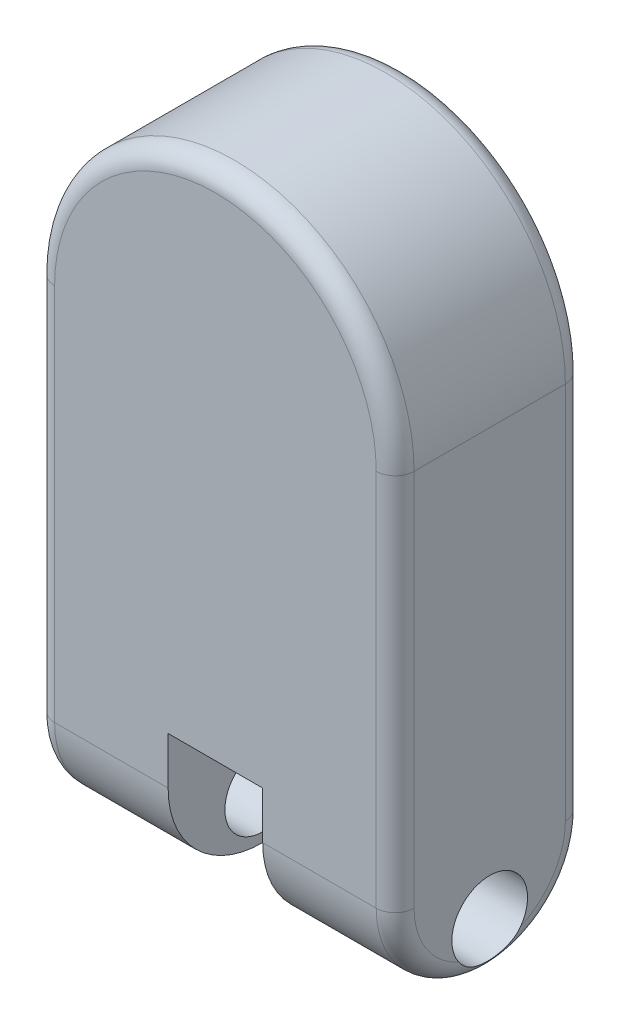
ISO-10303-21;
HEADER;
FILE_DESCRIPTION(('STEP AP214'),'2;1');
FILE_NAME('part.step','',(''),(''),'','','');
FILE_SCHEMA(('AUTOMOTIVE_DESIGN { 1 0 10303 214 1 1 1 1 }'));
ENDSEC;
DATA;
#1=APPLICATION_CONTEXT('core data for automotive mechanical design processes');
#2=APPLICATION_PROTOCOL_DEFINITION('international standard','automotive_design',2000,#1);
#3=PRODUCT_CONTEXT('',#1,'mechanical');
#4=PRODUCT('Part','Part','',(#3));
#5=PRODUCT_RELATED_PRODUCT_CATEGORY('part','',(#4));
#6=PRODUCT_DEFINITION_FORMATION('','',#4);
#7=PRODUCT_DEFINITION_CONTEXT('part definition',#1,'design');
#8=PRODUCT_DEFINITION('design','',#6,#7);
#9=PRODUCT_DEFINITION_SHAPE('','',#8);
#10=(LENGTH_UNIT() NAMED_UNIT(*) SI_UNIT(.MILLI.,.METRE.));
#11=(NAMED_UNIT(*) PLANE_ANGLE_UNIT() SI_UNIT($,.RADIAN.));
#12=(NAMED_UNIT(*) SI_UNIT($,.STERADIAN.) SOLID_ANGLE_UNIT());
#13=UNCERTAINTY_MEASURE_WITH_UNIT(LENGTH_MEASURE(1.E-05),#10,'distance_accuracy_value','');
#14=(GEOMETRIC_REPRESENTATION_CONTEXT(3) GLOBAL_UNCERTAINTY_ASSIGNED_CONTEXT((#13)) GLOBAL_UNIT_ASSIGNED_CONTEXT((#10,
#11,#12)) REPRESENTATION_CONTEXT('',''));
#15=CARTESIAN_POINT('',(0.,0.,0.));
#16=DIRECTION('',(0.,0.,1.));
#17=DIRECTION('',(1.,0.,0.));
#18=AXIS2_PLACEMENT_3D('',#15,#16,#17);
#19=CARTESIAN_POINT('',(-25.,-75.,-100.1));
#20=DIRECTION('',(0.,-1.,0.));
#21=DIRECTION('',(0.,0.,-1.));
#22=AXIS2_PLACEMENT_3D('',#19,#20,#21);
#23=PLANE('',#22);
#24=DIRECTION('',(1.,0.,0.));
#25=VECTOR('',#24,1.);
#26=CARTESIAN_POINT('',(-25.,-75.,-100.));
#27=LINE('',#26,#25);
#28=CARTESIAN_POINT('',(-25.,-75.,-100.));
#29=VERTEX_POINT('',#28);
#30=CARTESIAN_POINT('',(25.,-75.,-100.));
#31=VERTEX_POINT('',#30);
#32=EDGE_CURVE('E92',#29,#31,#27,.T.);
#33=ORIENTED_EDGE('',*,*,#32,.T.);
#34=CARTESIAN_POINT('',(23.5893264020334,-75.,-90.1));
#35=DIRECTION('',(0.,-1.,0.));
#36=DIRECTION('',(0.,0.,-1.));
#37=AXIS2_PLACEMENT_3D('',#34,#35,#36);
#38=CIRCLE('',#37,10.);
#39=CARTESIAN_POINT('',(23.5893264020334,-75.,-100.1));
#40=VERTEX_POINT('',#39);
#41=EDGE_CURVE('E12',#31,#40,#38,.F.);
#42=ORIENTED_EDGE('',*,*,#41,.T.);
#43=DIRECTION('',(1.,0.,0.));
#44=VECTOR('',#43,1.);
#45=CARTESIAN_POINT('',(-25.,-75.,-100.1));
#46=LINE('',#45,#44);
#47=CARTESIAN_POINT('',(-23.5893264020334,-75.,-100.1));
#48=VERTEX_POINT('',#47);
#49=EDGE_CURVE('E116',#48,#40,#46,.T.);
#50=ORIENTED_EDGE('',*,*,#49,.F.);
#51=CARTESIAN_POINT('',(-23.5893264020334,-75.,-90.1));
#52=DIRECTION('',(0.,-1.,0.));
#53=DIRECTION('',(0.,0.,-1.));
#54=AXIS2_PLACEMENT_3D('',#51,#52,#53);
#55=CIRCLE('',#54,10.);
#56=EDGE_CURVE('E55',#48,#29,#55,.F.);
#57=ORIENTED_EDGE('',*,*,#56,.T.);
#58=EDGE_LOOP('',(#33,#42,#50,#57));
#59=FACE_BOUND('',#58,.T.);
#60=ADVANCED_FACE('F46',(#59),#23,.F.);
#61=CARTESIAN_POINT('',(0.,0.,-100.1));
#62=DIRECTION('',(0.,0.,-1.));
#63=DIRECTION('',(-1.,0.,0.));
#64=AXIS2_PLACEMENT_3D('',#61,#62,#63);
#65=PLANE('',#64);
#66=ORIENTED_EDGE('',*,*,#49,.T.);
#67=DIRECTION('',(0.,1.,0.));
#68=VECTOR('',#67,1.);
#69=CARTESIAN_POINT('',(23.5893264020334,-105.,-100.1));
#70=LINE('',#69,#68);
#71=CARTESIAN_POINT('',(23.5893264020334,-103.589326402033,-100.1));
#72=VERTEX_POINT('',#71);
#73=EDGE_CURVE('E104',#40,#72,#70,.F.);
#74=ORIENTED_EDGE('',*,*,#73,.T.);
#75=DIRECTION('',(1.,0.,0.));
#76=VECTOR('',#75,1.);
#77=CARTESIAN_POINT('',(-25.,-103.589326402033,-100.1));
#78=LINE('',#77,#76);
#79=CARTESIAN_POINT('',(-23.5893264020334,-103.589326402033,-100.1));
#80=VERTEX_POINT('',#79);
#81=EDGE_CURVE('E70',#72,#80,#78,.F.);
#82=ORIENTED_EDGE('',*,*,#81,.T.);
#83=DIRECTION('',(0.,-1.,0.));
#84=VECTOR('',#83,1.);
#85=CARTESIAN_POINT('',(-23.5893264020334,-75.,-100.1));
#86=LINE('',#85,#84);
#87=EDGE_CURVE('E107',#80,#48,#86,.F.);
#88=ORIENTED_EDGE('',*,*,#87,.T.);
#89=EDGE_LOOP('',(#66,#74,#82,#88));
#90=FACE_BOUND('',#89,.T.);
#91=ADVANCED_FACE('F120',(#90),#65,.T.);
#92=CARTESIAN_POINT('',(0.,0.,-100.));
#93=DIRECTION('',(0.,0.,-1.));
#94=DIRECTION('',(-1.,0.,0.));
#95=AXIS2_PLACEMENT_3D('',#92,#93,#94);
#96=PLANE('',#95);
#97=ORIENTED_EDGE('',*,*,#32,.F.);
#98=DIRECTION('',(0.,1.,0.));
#99=VECTOR('',#98,1.);
#100=CARTESIAN_POINT('',(-25.,-105.,-100.));
#101=LINE('',#100,#99);
#102=CARTESIAN_POINT('',(-25.,-105.,-100.));
#103=VERTEX_POINT('',#102);
#104=EDGE_CURVE('E115',#103,#29,#101,.T.);
#105=ORIENTED_EDGE('',*,*,#104,.F.);
#106=DIRECTION('',(-1.,0.,0.));
#107=VECTOR('',#106,1.);
#108=CARTESIAN_POINT('',(25.,-105.,-100.));
#109=LINE('',#108,#107);
#110=CARTESIAN_POINT('',(25.,-105.,-100.));
#111=VERTEX_POINT('',#110);
#112=EDGE_CURVE('E95',#111,#103,#109,.T.);
#113=ORIENTED_EDGE('',*,*,#112,.F.);
#114=DIRECTION('',(0.,-1.,0.));
#115=VECTOR('',#114,1.);
#116=CARTESIAN_POINT('',(25.,-75.,-100.));
#117=LINE('',#116,#115);
#118=EDGE_CURVE('E89',#31,#111,#117,.T.);
#119=ORIENTED_EDGE('',*,*,#118,.F.);
#120=EDGE_LOOP('',(#97,#105,#113,#119));
#121=FACE_BOUND('',#120,.T.);
#122=ADVANCED_FACE('F91',(#121),#96,.F.);
#123=CARTESIAN_POINT('',(-23.5893264020334,-105.,-90.1));
#124=DIRECTION('',(0.,1.,0.));
#125=DIRECTION('',(0.,0.,1.));
#126=AXIS2_PLACEMENT_3D('',#123,#124,#125);
#127=CYLINDRICAL_SURFACE('',#126,10.);
#128=ORIENTED_EDGE('',*,*,#56,.F.);
#129=ORIENTED_EDGE('',*,*,#87,.F.);
#130=CARTESIAN_POINT('',(-23.5893264020334,-103.589326402033,-90.1));
#131=DIRECTION('',(-0.707106781186547,0.707106781186547,0.));
#132=DIRECTION('',(0.707106781186547,0.707106781186547,0.));
#133=AXIS2_PLACEMENT_3D('',#130,#131,#132);
#134=ELLIPSE('',#133,14.1421356237309,10.);
#135=EDGE_CURVE('E50',#103,#80,#134,.F.);
#136=ORIENTED_EDGE('',*,*,#135,.F.);
#137=ORIENTED_EDGE('',*,*,#104,.T.);
#138=EDGE_LOOP('',(#128,#129,#136,#137));
#139=FACE_BOUND('',#138,.T.);
#140=ADVANCED_FACE('F48',(#139),#127,.T.);
#141=CARTESIAN_POINT('',(25.,-103.589326402033,-90.1));
#142=DIRECTION('',(-1.,0.,0.));
#143=DIRECTION('',(0.,0.,1.));
#144=AXIS2_PLACEMENT_3D('',#141,#142,#143);
#145=CYLINDRICAL_SURFACE('',#144,10.);
#146=ORIENTED_EDGE('',*,*,#135,.T.);
#147=ORIENTED_EDGE('',*,*,#81,.F.);
#148=CARTESIAN_POINT('',(23.5893264020334,-103.589326402033,-90.1));
#149=DIRECTION('',(-0.707106781186547,-0.707106781186548,0.));
#150=DIRECTION('',(-0.707106781186548,0.707106781186547,0.));
#151=AXIS2_PLACEMENT_3D('',#148,#149,#150);
#152=ELLIPSE('',#151,14.142135623731,10.);
#153=EDGE_CURVE('E63',#111,#72,#152,.F.);
#154=ORIENTED_EDGE('',*,*,#153,.F.);
#155=ORIENTED_EDGE('',*,*,#112,.T.);
#156=EDGE_LOOP('',(#146,#147,#154,#155));
#157=FACE_BOUND('',#156,.T.);
#158=ADVANCED_FACE('F113',(#157),#145,.T.);
#159=CARTESIAN_POINT('',(23.5893264020334,-75.,-90.1));
#160=DIRECTION('',(0.,-1.,0.));
#161=DIRECTION('',(1.,0.,0.));
#162=AXIS2_PLACEMENT_3D('',#159,#160,#161);
#163=CYLINDRICAL_SURFACE('',#162,10.);
#164=ORIENTED_EDGE('',*,*,#41,.F.);
#165=ORIENTED_EDGE('',*,*,#118,.T.);
#166=ORIENTED_EDGE('',*,*,#153,.T.);
#167=ORIENTED_EDGE('',*,*,#73,.F.);
#168=EDGE_LOOP('',(#164,#165,#166,#167));
#169=FACE_BOUND('',#168,.T.);
#170=ADVANCED_FACE('F103',(#169),#163,.T.);
#171=CLOSED_SHELL('',(#60,#91,#122,#140,#158,#170));
#172=MANIFOLD_SOLID_BREP('B2',#171);
#173=CARTESIAN_POINT('',(0.,-75.,-50.));
#174=DIRECTION('',(1.,0.,0.));
#175=DIRECTION('',(0.,0.,-1.));
#176=AXIS2_PLACEMENT_3D('',#173,#174,#175);
#177=CYLINDRICAL_SURFACE('',#176,50.);
#178=DIRECTION('',(1.,0.,0.));
#179=VECTOR('',#178,1.);
#180=CARTESIAN_POINT('',(0.,-75.,0.));
#181=LINE('',#180,#179);
#182=CARTESIAN_POINT('',(-85.,-75.,0.));
#183=VERTEX_POINT('',#182);
#184=CARTESIAN_POINT('',(-25.,-75.,0.));
#185=VERTEX_POINT('',#184);
#186=EDGE_CURVE('E367',#183,#185,#181,.T.);
#187=ORIENTED_EDGE('',*,*,#186,.F.);
#188=CARTESIAN_POINT('',(-85.,-75.,-50.));
#189=DIRECTION('',(-1.,0.,0.));
#190=DIRECTION('',(0.,-1.,0.));
#191=AXIS2_PLACEMENT_3D('',#188,#189,#190);
#192=CIRCLE('',#191,50.);
#193=CARTESIAN_POINT('',(-85.,-125.,-50.));
#194=VERTEX_POINT('',#193);
#195=EDGE_CURVE('E191',#183,#194,#192,.F.);
#196=ORIENTED_EDGE('',*,*,#195,.T.);
#197=DIRECTION('',(1.,0.,0.));
#198=VECTOR('',#197,1.);
#199=CARTESIAN_POINT('',(-95.,-125.,-50.));
#200=LINE('',#199,#198);
#201=CARTESIAN_POINT('',(-25.,-125.,-50.));
#202=VERTEX_POINT('',#201);
#203=EDGE_CURVE('E334',#202,#194,#200,.F.);
#204=ORIENTED_EDGE('',*,*,#203,.F.);
#205=CARTESIAN_POINT('',(-25.,-75.,-50.));
#206=DIRECTION('',(-1.,0.,0.));
#207=DIRECTION('',(0.,0.,1.));
#208=AXIS2_PLACEMENT_3D('',#205,#206,#207);
#209=CIRCLE('',#208,50.);
#210=EDGE_CURVE('E349',#185,#202,#209,.F.);
#211=ORIENTED_EDGE('',*,*,#210,.F.);
#212=EDGE_LOOP('',(#187,#196,#204,#211));
#213=FACE_BOUND('',#212,.T.);
#214=ADVANCED_FACE('F169',(#213),#177,.T.);
#215=CARTESIAN_POINT('',(-95.,-75.,-50.));
#216=DIRECTION('',(-1.,0.,0.));
#217=DIRECTION('',(0.,0.,1.));
#218=AXIS2_PLACEMENT_3D('',#215,#216,#217);
#219=CYLINDRICAL_SURFACE('',#218,50.);
#220=ORIENTED_EDGE('',*,*,#203,.T.);
#221=CARTESIAN_POINT('',(-85.,-75.,-50.));
#222=DIRECTION('',(-1.,0.,0.));
#223=DIRECTION('',(0.,-1.,0.));
#224=AXIS2_PLACEMENT_3D('',#221,#222,#223);
#225=CIRCLE('',#224,50.);
#226=CARTESIAN_POINT('',(-85.,-75.,-100.));
#227=VERTEX_POINT('',#226);
#228=EDGE_CURVE('E177',#194,#227,#225,.F.);
#229=ORIENTED_EDGE('',*,*,#228,.T.);
#230=DIRECTION('',(1.,0.,0.));
#231=VECTOR('',#230,1.);
#232=CARTESIAN_POINT('',(-95.,-75.,-100.));
#233=LINE('',#232,#231);
#234=CARTESIAN_POINT('',(-25.,-75.,-100.));
#235=VERTEX_POINT('',#234);
#236=EDGE_CURVE('E363',#235,#227,#233,.F.);
#237=ORIENTED_EDGE('',*,*,#236,.F.);
#238=CARTESIAN_POINT('',(-25.,-75.,-50.));
#239=DIRECTION('',(-1.,0.,0.));
#240=DIRECTION('',(0.,0.,1.));
#241=AXIS2_PLACEMENT_3D('',#238,#239,#240);
#242=CIRCLE('',#241,50.);
#243=EDGE_CURVE('E355',#202,#235,#242,.F.);
#244=ORIENTED_EDGE('',*,*,#243,.F.);
#245=EDGE_LOOP('',(#220,#229,#237,#244));
#246=FACE_BOUND('',#245,.T.);
#247=ADVANCED_FACE('F466',(#246),#219,.T.);
#248=CARTESIAN_POINT('',(95.,125.,-100.));
#249=DIRECTION('',(1.,0.,0.));
#250=DIRECTION('',(0.,1.,0.));
#251=AXIS2_PLACEMENT_3D('',#248,#249,#250);
#252=PLANE('',#251);
#253=CARTESIAN_POINT('',(95.,-75.,-50.));
#254=DIRECTION('',(1.,0.,0.));
#255=DIRECTION('',(0.,1.,0.));
#256=AXIS2_PLACEMENT_3D('',#253,#254,#255);
#257=CIRCLE('',#256,40.);
#258=CARTESIAN_POINT('',(95.0000000000001,-111.5,-66.3630681719536));
#259=VERTEX_POINT('',#258);
#260=CARTESIAN_POINT('',(95.,-75.,-90.));
#261=VERTEX_POINT('',#260);
#262=EDGE_CURVE('E389',#259,#261,#257,.T.);
#263=ORIENTED_EDGE('',*,*,#262,.T.);
#264=DIRECTION('',(0.,1.,0.));
#265=VECTOR('',#264,1.);
#266=CARTESIAN_POINT('',(95.,125.,-90.));
#267=LINE('',#266,#265);
#268=CARTESIAN_POINT('',(95.,125.,-90.));
#269=VERTEX_POINT('',#268);
#270=EDGE_CURVE('E391',#261,#269,#267,.T.);
#271=ORIENTED_EDGE('',*,*,#270,.T.);
#272=DIRECTION('',(0.,0.,1.));
#273=VECTOR('',#272,1.);
#274=CARTESIAN_POINT('',(95.,125.,-100.));
#275=LINE('',#274,#273);
#276=CARTESIAN_POINT('',(95.,125.,-9.99999999999999));
#277=VERTEX_POINT('',#276);
#278=EDGE_CURVE('E345',#269,#277,#275,.T.);
#279=ORIENTED_EDGE('',*,*,#278,.T.);
#280=DIRECTION('',(0.,1.,0.));
#281=VECTOR('',#280,1.);
#282=CARTESIAN_POINT('',(95.,125.,-9.99999999999999));
#283=LINE('',#282,#281);
#284=CARTESIAN_POINT('',(95.,-75.,-10.));
#285=VERTEX_POINT('',#284);
#286=EDGE_CURVE('E385',#277,#285,#283,.F.);
#287=ORIENTED_EDGE('',*,*,#286,.T.);
#288=CARTESIAN_POINT('',(95.,-75.,-50.));
#289=DIRECTION('',(1.,0.,0.));
#290=DIRECTION('',(0.,1.,0.));
#291=AXIS2_PLACEMENT_3D('',#288,#289,#290);
#292=CIRCLE('',#291,40.);
#293=CARTESIAN_POINT('',(95.,-111.5,-33.6369318280464));
#294=VERTEX_POINT('',#293);
#295=EDGE_CURVE('E387',#285,#294,#292,.T.);
#296=ORIENTED_EDGE('',*,*,#295,.T.);
#297=CARTESIAN_POINT('',(95.,-100.,-50.));
#298=DIRECTION('',(-1.,0.,0.));
#299=DIRECTION('',(0.,-1.,0.));
#300=AXIS2_PLACEMENT_3D('',#297,#298,#299);
#301=CIRCLE('',#300,20.);
#302=EDGE_CURVE('E335',#294,#259,#301,.T.);
#303=ORIENTED_EDGE('',*,*,#302,.T.);
#304=EDGE_LOOP('',(#263,#271,#279,#287,#296,#303));
#305=FACE_BOUND('',#304,.T.);
#306=ADVANCED_FACE('F471',(#305),#252,.T.);
#307=CARTESIAN_POINT('',(-95.,125.,-100.));
#308=DIRECTION('',(-1.,0.,0.));
#309=DIRECTION('',(0.,-1.,0.));
#310=AXIS2_PLACEMENT_3D('',#307,#308,#309);
#311=PLANE('',#310);
#312=CARTESIAN_POINT('',(-95.,-75.,-50.));
#313=DIRECTION('',(-1.,0.,0.));
#314=DIRECTION('',(0.,-1.,0.));
#315=AXIS2_PLACEMENT_3D('',#312,#313,#314);
#316=CIRCLE('',#315,40.);
#317=CARTESIAN_POINT('',(-95.,-111.5,-33.6369318280464));
#318=VERTEX_POINT('',#317);
#319=CARTESIAN_POINT('',(-95.,-75.,-10.));
#320=VERTEX_POINT('',#319);
#321=EDGE_CURVE('E539',#318,#320,#316,.T.);
#322=ORIENTED_EDGE('',*,*,#321,.T.);
#323=DIRECTION('',(0.,-1.,0.));
#324=VECTOR('',#323,1.);
#325=CARTESIAN_POINT('',(-95.,125.,-9.99999999999999));
#326=LINE('',#325,#324);
#327=CARTESIAN_POINT('',(-95.,125.,-9.99999999999999));
#328=VERTEX_POINT('',#327);
#329=EDGE_CURVE('E437',#320,#328,#326,.F.);
#330=ORIENTED_EDGE('',*,*,#329,.T.);
#331=DIRECTION('',(0.,0.,1.));
#332=VECTOR('',#331,1.);
#333=CARTESIAN_POINT('',(-95.,125.,-100.));
#334=LINE('',#333,#332);
#335=CARTESIAN_POINT('',(-95.,125.,-90.));
#336=VERTEX_POINT('',#335);
#337=EDGE_CURVE('E346',#336,#328,#334,.T.);
#338=ORIENTED_EDGE('',*,*,#337,.F.);
#339=DIRECTION('',(0.,-1.,0.));
#340=VECTOR('',#339,1.);
#341=CARTESIAN_POINT('',(-95.,-75.,-90.));
#342=LINE('',#341,#340);
#343=CARTESIAN_POINT('',(-95.,-75.,-90.));
#344=VERTEX_POINT('',#343);
#345=EDGE_CURVE('E533',#336,#344,#342,.T.);
#346=ORIENTED_EDGE('',*,*,#345,.T.);
#347=CARTESIAN_POINT('',(-95.,-75.,-50.));
#348=DIRECTION('',(-1.,0.,0.));
#349=DIRECTION('',(0.,-1.,0.));
#350=AXIS2_PLACEMENT_3D('',#347,#348,#349);
#351=CIRCLE('',#350,40.);
#352=CARTESIAN_POINT('',(-95.,-111.5,-66.3630681719536));
#353=VERTEX_POINT('',#352);
#354=EDGE_CURVE('E538',#344,#353,#351,.T.);
#355=ORIENTED_EDGE('',*,*,#354,.T.);
#356=CARTESIAN_POINT('',(-95.,-100.,-50.));
#357=DIRECTION('',(-1.,0.,0.));
#358=DIRECTION('',(0.,-1.,0.));
#359=AXIS2_PLACEMENT_3D('',#356,#357,#358);
#360=CIRCLE('',#359,20.);
#361=EDGE_CURVE('E339',#318,#353,#360,.T.);
#362=ORIENTED_EDGE('',*,*,#361,.F.);
#363=EDGE_LOOP('',(#322,#330,#338,#346,#355,#362));
#364=FACE_BOUND('',#363,.T.);
#365=ADVANCED_FACE('F544',(#364),#311,.T.);
#366=CARTESIAN_POINT('',(0.,0.,-100.));
#367=DIRECTION('',(0.,0.,1.));
#368=DIRECTION('',(1.,0.,0.));
#369=AXIS2_PLACEMENT_3D('',#366,#367,#368);
#370=PLANE('',#369);
#371=CARTESIAN_POINT('',(0.,125.,-100.));
#372=DIRECTION('',(0.,0.,1.));
#373=DIRECTION('',(1.,0.,0.));
#374=AXIS2_PLACEMENT_3D('',#371,#372,#373);
#375=CIRCLE('',#374,85.);
#376=CARTESIAN_POINT('',(-85.,125.,-100.));
#377=VERTEX_POINT('',#376);
#378=CARTESIAN_POINT('',(85.,125.,-100.));
#379=VERTEX_POINT('',#378);
#380=EDGE_CURVE('E380',#377,#379,#375,.F.);
#381=ORIENTED_EDGE('',*,*,#380,.T.);
#382=DIRECTION('',(0.,1.,0.));
#383=VECTOR('',#382,1.);
#384=CARTESIAN_POINT('',(85.,-75.,-100.));
#385=LINE('',#384,#383);
#386=CARTESIAN_POINT('',(85.,-75.,-100.));
#387=VERTEX_POINT('',#386);
#388=EDGE_CURVE('E383',#379,#387,#385,.F.);
#389=ORIENTED_EDGE('',*,*,#388,.T.);
#390=CARTESIAN_POINT('',(25.,-75.,-100.));
#391=VERTEX_POINT('',#390);
#392=EDGE_CURVE('E368',#387,#391,#233,.F.);
#393=ORIENTED_EDGE('',*,*,#392,.T.);
#394=DIRECTION('',(-1.,0.,0.));
#395=VECTOR('',#394,1.);
#396=CARTESIAN_POINT('',(-25.,-75.,-100.));
#397=LINE('',#396,#395);
#398=EDGE_CURVE('E328',#391,#235,#397,.T.);
#399=ORIENTED_EDGE('',*,*,#398,.T.);
#400=ORIENTED_EDGE('',*,*,#236,.T.);
#401=DIRECTION('',(0.,-1.,0.));
#402=VECTOR('',#401,1.);
#403=CARTESIAN_POINT('',(-85.,125.,-100.));
#404=LINE('',#403,#402);
#405=EDGE_CURVE('E378',#227,#377,#404,.F.);
#406=ORIENTED_EDGE('',*,*,#405,.T.);
#407=EDGE_LOOP('',(#381,#389,#393,#399,#400,#406));
#408=FACE_BOUND('',#407,.T.);
#409=ADVANCED_FACE('F583',(#408),#370,.F.);
#410=CARTESIAN_POINT('',(0.,0.,0.));
#411=DIRECTION('',(0.,0.,1.));
#412=DIRECTION('',(1.,0.,0.));
#413=AXIS2_PLACEMENT_3D('',#410,#411,#412);
#414=PLANE('',#413);
#415=DIRECTION('',(0.,-1.,0.));
#416=VECTOR('',#415,1.);
#417=CARTESIAN_POINT('',(-25.,-75.,0.));
#418=LINE('',#417,#416);
#419=CARTESIAN_POINT('',(-25.,-50.,0.));
#420=VERTEX_POINT('',#419);
#421=EDGE_CURVE('E313',#420,#185,#418,.T.);
#422=ORIENTED_EDGE('',*,*,#421,.F.);
#423=DIRECTION('',(-1.,0.,0.));
#424=VECTOR('',#423,1.);
#425=CARTESIAN_POINT('',(-25.,-50.,0.));
#426=LINE('',#425,#424);
#427=CARTESIAN_POINT('',(25.,-50.,0.));
#428=VERTEX_POINT('',#427);
#429=EDGE_CURVE('E320',#428,#420,#426,.T.);
#430=ORIENTED_EDGE('',*,*,#429,.F.);
#431=DIRECTION('',(0.,1.,0.));
#432=VECTOR('',#431,1.);
#433=CARTESIAN_POINT('',(25.,-50.,0.));
#434=LINE('',#433,#432);
#435=CARTESIAN_POINT('',(25.,-75.,0.));
#436=VERTEX_POINT('',#435);
#437=EDGE_CURVE('E304',#436,#428,#434,.T.);
#438=ORIENTED_EDGE('',*,*,#437,.F.);
#439=CARTESIAN_POINT('',(85.,-75.,0.));
#440=VERTEX_POINT('',#439);
#441=EDGE_CURVE('E370',#436,#440,#181,.T.);
#442=ORIENTED_EDGE('',*,*,#441,.T.);
#443=DIRECTION('',(0.,1.,0.));
#444=VECTOR('',#443,1.);
#445=CARTESIAN_POINT('',(85.,0.,0.));
#446=LINE('',#445,#444);
#447=CARTESIAN_POINT('',(85.,125.,0.));
#448=VERTEX_POINT('',#447);
#449=EDGE_CURVE('E524',#440,#448,#446,.T.);
#450=ORIENTED_EDGE('',*,*,#449,.T.);
#451=CARTESIAN_POINT('',(0.,125.,0.));
#452=DIRECTION('',(0.,0.,1.));
#453=DIRECTION('',(1.,0.,0.));
#454=AXIS2_PLACEMENT_3D('',#451,#452,#453);
#455=CIRCLE('',#454,85.);
#456=CARTESIAN_POINT('',(-85.,125.,0.));
#457=VERTEX_POINT('',#456);
#458=EDGE_CURVE('E529',#448,#457,#455,.T.);
#459=ORIENTED_EDGE('',*,*,#458,.T.);
#460=DIRECTION('',(0.,-1.,0.));
#461=VECTOR('',#460,1.);
#462=CARTESIAN_POINT('',(-85.,0.,0.));
#463=LINE('',#462,#461);
#464=EDGE_CURVE('E498',#457,#183,#463,.T.);
#465=ORIENTED_EDGE('',*,*,#464,.T.);
#466=ORIENTED_EDGE('',*,*,#186,.T.);
#467=EDGE_LOOP('',(#422,#430,#438,#442,#450,#459,#465,#466));
#468=FACE_BOUND('',#467,.T.);
#469=ADVANCED_FACE('F593',(#468),#414,.T.);
#470=CARTESIAN_POINT('',(25.,-150.,-100.));
#471=DIRECTION('',(1.,0.,0.));
#472=DIRECTION('',(0.,0.,-1.));
#473=AXIS2_PLACEMENT_3D('',#470,#471,#472);
#474=PLANE('',#473);
#475=CARTESIAN_POINT('',(25.,-75.,-50.));
#476=DIRECTION('',(1.,0.,0.));
#477=DIRECTION('',(0.,0.,-1.));
#478=AXIS2_PLACEMENT_3D('',#475,#476,#477);
#479=CIRCLE('',#478,50.);
#480=CARTESIAN_POINT('',(25.,-125.,-50.));
#481=VERTEX_POINT('',#480);
#482=EDGE_CURVE('E358',#481,#436,#479,.F.);
#483=ORIENTED_EDGE('',*,*,#482,.T.);
#484=ORIENTED_EDGE('',*,*,#437,.T.);
#485=DIRECTION('',(0.,0.,1.));
#486=VECTOR('',#485,1.);
#487=CARTESIAN_POINT('',(25.,-50.,-99.));
#488=LINE('',#487,#486);
#489=CARTESIAN_POINT('',(25.,-50.,-99.));
#490=VERTEX_POINT('',#489);
#491=EDGE_CURVE('E296',#490,#428,#488,.T.);
#492=ORIENTED_EDGE('',*,*,#491,.F.);
#493=DIRECTION('',(0.,1.,0.));
#494=VECTOR('',#493,1.);
#495=CARTESIAN_POINT('',(25.,-50.,-99.));
#496=LINE('',#495,#494);
#497=CARTESIAN_POINT('',(25.,-74.4302970896538,-99.));
#498=VERTEX_POINT('',#497);
#499=EDGE_CURVE('E302',#498,#490,#496,.T.);
#500=ORIENTED_EDGE('',*,*,#499,.F.);
#501=CARTESIAN_POINT('',(25.,-161.602540378444,-50.));
#502=DIRECTION('',(1.,0.,0.));
#503=DIRECTION('',(0.,0.,-1.));
#504=AXIS2_PLACEMENT_3D('',#501,#502,#503);
#505=CIRCLE('',#504,100.);
#506=EDGE_CURVE('E329',#391,#498,#505,.T.);
#507=ORIENTED_EDGE('',*,*,#506,.F.);
#508=CARTESIAN_POINT('',(25.,-75.,-50.));
#509=DIRECTION('',(1.,0.,0.));
#510=DIRECTION('',(0.,0.,-1.));
#511=AXIS2_PLACEMENT_3D('',#508,#509,#510);
#512=CIRCLE('',#511,50.);
#513=EDGE_CURVE('E360',#391,#481,#512,.F.);
#514=ORIENTED_EDGE('',*,*,#513,.T.);
#515=EDGE_LOOP('',(#483,#484,#492,#500,#507,#514));
#516=FACE_BOUND('',#515,.T.);
#517=CARTESIAN_POINT('',(25.,-100.,-50.));
#518=DIRECTION('',(1.,0.,0.));
#519=DIRECTION('',(0.,0.,-1.));
#520=AXIS2_PLACEMENT_3D('',#517,#518,#519);
#521=CIRCLE('',#520,20.);
#522=CARTESIAN_POINT('',(25.,-100.,-70.));
#523=VERTEX_POINT('',#522);
#524=EDGE_CURVE('E342',#523,#523,#521,.T.);
#525=ORIENTED_EDGE('',*,*,#524,.T.);
#526=EDGE_LOOP('',(#525));
#527=FACE_BOUND('',#526,.T.);
#528=ADVANCED_FACE('F299',(#516,#527),#474,.F.);
#529=CARTESIAN_POINT('',(-25.,-150.,-100.));
#530=DIRECTION('',(-1.,0.,0.));
#531=DIRECTION('',(0.,0.,1.));
#532=AXIS2_PLACEMENT_3D('',#529,#530,#531);
#533=PLANE('',#532);
#534=ORIENTED_EDGE('',*,*,#421,.T.);
#535=ORIENTED_EDGE('',*,*,#210,.T.);
#536=ORIENTED_EDGE('',*,*,#243,.T.);
#537=CARTESIAN_POINT('',(-25.,-161.602540378444,-50.));
#538=DIRECTION('',(1.,0.,0.));
#539=DIRECTION('',(0.,0.,-1.));
#540=AXIS2_PLACEMENT_3D('',#537,#538,#539);
#541=CIRCLE('',#540,100.);
#542=CARTESIAN_POINT('',(-25.,-74.4302970896538,-99.));
#543=VERTEX_POINT('',#542);
#544=EDGE_CURVE('E325',#235,#543,#541,.T.);
#545=ORIENTED_EDGE('',*,*,#544,.T.);
#546=DIRECTION('',(0.,-1.,0.));
#547=VECTOR('',#546,1.);
#548=CARTESIAN_POINT('',(-25.,-75.,-99.));
#549=LINE('',#548,#547);
#550=CARTESIAN_POINT('',(-25.,-50.,-99.));
#551=VERTEX_POINT('',#550);
#552=EDGE_CURVE('E184',#551,#543,#549,.T.);
#553=ORIENTED_EDGE('',*,*,#552,.F.);
#554=DIRECTION('',(0.,0.,1.));
#555=VECTOR('',#554,1.);
#556=CARTESIAN_POINT('',(-25.,-50.,-99.));
#557=LINE('',#556,#555);
#558=EDGE_CURVE('E309',#551,#420,#557,.T.);
#559=ORIENTED_EDGE('',*,*,#558,.T.);
#560=EDGE_LOOP('',(#534,#535,#536,#545,#553,#559));
#561=FACE_BOUND('',#560,.T.);
#562=CARTESIAN_POINT('',(-25.,-100.,-50.));
#563=DIRECTION('',(-1.,0.,0.));
#564=DIRECTION('',(0.,0.,1.));
#565=AXIS2_PLACEMENT_3D('',#562,#563,#564);
#566=CIRCLE('',#565,20.);
#567=CARTESIAN_POINT('',(-25.,-100.,-30.));
#568=VERTEX_POINT('',#567);
#569=EDGE_CURVE('E338',#568,#568,#566,.T.);
#570=ORIENTED_EDGE('',*,*,#569,.T.);
#571=EDGE_LOOP('',(#570));
#572=FACE_BOUND('',#571,.T.);
#573=ADVANCED_FACE('F422',(#561,#572),#533,.F.);
#574=CARTESIAN_POINT('',(95.,-100.,-50.));
#575=DIRECTION('',(-1.,0.,0.));
#576=DIRECTION('',(0.,-1.,0.));
#577=AXIS2_PLACEMENT_3D('',#574,#575,#576);
#578=CYLINDRICAL_SURFACE('',#577,20.);
#579=CARTESIAN_POINT('',(-95.,-111.5,-66.3630681719536));
#580=CARTESIAN_POINT('',(-94.9999944988369,-111.717635786294,-66.2101150233157));
#581=CARTESIAN_POINT('',(-94.9972251505422,-111.932182024762,-66.0528421805291));
#582=CARTESIAN_POINT('',(-94.9867556613727,-112.35473388776,-65.7299474304971));
#583=CARTESIAN_POINT('',(-94.9790561221654,-112.562740307143,-65.5643265442968));
#584=CARTESIAN_POINT('',(-94.9494718778201,-113.176161814739,-65.0555886797702));
#585=CARTESIAN_POINT('',(-94.9210996400918,-113.571325329765,-64.7003530754296));
#586=CARTESIAN_POINT('',(-94.8515096756831,-114.330811895632,-63.9609577577295));
#587=CARTESIAN_POINT('',(-94.8103152955771,-114.695189480587,-63.5768515684689));
#588=CARTESIAN_POINT('',(-94.7190573029856,-115.391950208584,-62.7815251896323));
#589=CARTESIAN_POINT('',(-94.6689923089183,-115.724328355308,-62.3703007827167));
#590=CARTESIAN_POINT('',(-94.5631593930954,-116.358618976357,-61.5187034560061));
#591=CARTESIAN_POINT('',(-94.5073357106278,-116.660163582177,-61.0780636594513));
#592=CARTESIAN_POINT('',(-94.3940622995594,-117.226993438192,-60.1742441935076));
#593=CARTESIAN_POINT('',(-94.3366125479803,-117.492278175682,-59.7110642055318));
#594=CARTESIAN_POINT('',(-94.223501755816,-117.985054029716,-58.7648363026766));
#595=CARTESIAN_POINT('',(-94.167840615512,-118.212547256171,-58.2817894988468));
#596=CARTESIAN_POINT('',(-94.0614849028067,-118.628363325728,-57.2985605452277));
#597=CARTESIAN_POINT('',(-94.0107905215469,-118.816684661646,-56.7983777369727));
#598=CARTESIAN_POINT('',(-93.914628020795,-119.162335252227,-55.7553050669512));
#599=CARTESIAN_POINT('',(-93.8696146444547,-119.31732359583,-55.2115959974652));
#600=CARTESIAN_POINT('',(-93.7912772213223,-119.580856141992,-54.1121164115952));
#601=CARTESIAN_POINT('',(-93.7579530630838,-119.689400787352,-53.5563460102591));
#602=CARTESIAN_POINT('',(-93.7183397843355,-119.816752364834,-52.7160701639446));
#603=CARTESIAN_POINT('',(-93.7068534918599,-119.853323941299,-52.4343883277259));
#604=CARTESIAN_POINT('',(-93.6875556329067,-119.914450380322,-51.869577925022));
#605=CARTESIAN_POINT('',(-93.6797440577708,-119.939005271195,-51.586449361947));
#606=CARTESIAN_POINT('',(-93.6679366207012,-119.976034163262,-51.0192418997108));
#607=CARTESIAN_POINT('',(-93.6639419207102,-119.988504485659,-50.7351627375596));
#608=CARTESIAN_POINT('',(-93.6598264732936,-120.001327339773,-50.1666967726028));
#609=CARTESIAN_POINT('',(-93.6597058137055,-120.001679596733,-49.882309962968));
#610=CARTESIAN_POINT('',(-93.6615493262836,-119.995960582491,-49.5980542531014));
#611=B_SPLINE_CURVE_WITH_KNOTS('',3,(#579,#580,#581,#582,#583,#584,#585,#586,#587,#588,#589,
#590,#591,#592,#593,#594,#595,#596,#597,#598,#599,#600,#601,#602,#603,#604,#605,#606,#607,#608,
#609,#610),.UNSPECIFIED.,.F.,.F.,(4,2,2,2,2,2,2,2,2,2,2,2,2,2,2,4),(0.,0.797874642750549,
1.59565193352406,3.1899412608992,4.78134451960054,6.37299585463969,7.98184001143661,
9.59070691451071,11.1994839638915,12.8083229014095,14.5077128583875,16.2070866127463,
17.0596892460926,17.91228987052,18.7651499631725,19.6180293930039),.UNSPECIFIED.);
#612=CARTESIAN_POINT('',(-93.6602540378444,-120.,-50.));
#613=VERTEX_POINT('',#612);
#614=EDGE_CURVE('E429',#353,#613,#611,.T.);
#615=ORIENTED_EDGE('',*,*,#614,.T.);
#616=CARTESIAN_POINT('',(-93.6602540378444,-120.,-50.));
#617=CARTESIAN_POINT('',(-93.660247528865,-120.000000557423,-49.7291162562174));
#618=CARTESIAN_POINT('',(-93.6620203059655,-119.994495715576,-49.4582663052626));
#619=CARTESIAN_POINT('',(-93.6690632302412,-119.972496289671,-48.9170644816353));
#620=CARTESIAN_POINT('',(-93.6743333002116,-119.956001948214,-48.6467125980998));
#621=CARTESIAN_POINT('',(-93.6952902819852,-119.8900894424,-47.8373209986366));
#622=CARTESIAN_POINT('',(-93.7161240917141,-119.824241746037,-47.2996541799823));
#623=CARTESIAN_POINT('',(-93.7701739357349,-119.649543192614,-46.2334838396406));
#624=CARTESIAN_POINT('',(-93.8033583037589,-119.540802269524,-45.7049604702912));
#625=CARTESIAN_POINT('',(-93.8801161670473,-119.281208901752,-44.6590938773701));
#626=CARTESIAN_POINT('',(-93.9236903013259,-119.130353866779,-44.1417513436021));
#627=CARTESIAN_POINT('',(-94.0189152913429,-118.786789461718,-43.1189296044383));
#628=CARTESIAN_POINT('',(-94.0706068716683,-118.593867036125,-42.6135258599768));
#629=CARTESIAN_POINT('',(-94.1788835403941,-118.16796707267,-41.6204488654864));
#630=CARTESIAN_POINT('',(-94.2354685830894,-117.934989908899,-41.1327754499163));
#631=CARTESIAN_POINT('',(-94.3502215235499,-117.430402873405,-40.1779497284365));
#632=CARTESIAN_POINT('',(-94.4083896442132,-117.158787538414,-39.7108003367798));
#633=CARTESIAN_POINT('',(-94.5227473765823,-116.578517537487,-38.7998012021265));
#634=CARTESIAN_POINT('',(-94.5789368427548,-116.269860154377,-38.3559531718098));
#635=CARTESIAN_POINT('',(-94.6878982994192,-115.602912464245,-37.4753289636808));
#636=CARTESIAN_POINT('',(-94.740412180585,-115.243038677624,-37.0397174887075));
#637=CARTESIAN_POINT('',(-94.8345685865417,-114.487138492257,-36.1999281519389));
#638=CARTESIAN_POINT('',(-94.8762127470129,-114.09111754507,-35.7957455671454));
#639=CARTESIAN_POINT('',(-94.9437724111679,-113.26432007541,-35.0206968408248));
#640=CARTESIAN_POINT('',(-94.969646571122,-112.833455521703,-34.6499204268788));
#641=CARTESIAN_POINT('',(-94.992406932906,-112.164262783443,-34.1219764911395));
#642=CARTESIAN_POINT('',(-94.997317042392,-111.937265917523,-33.9506217314705));
#643=CARTESIAN_POINT('',(-95.001019493978,-111.47611190923,-33.6177002554482));
#644=CARTESIAN_POINT('',(-94.9998109947272,-111.241953786537,-33.4561348882949));
#645=CARTESIAN_POINT('',(-94.9951651075579,-111.004453188326,-33.299640422256));
#646=B_SPLINE_CURVE_WITH_KNOTS('',3,(#616,#617,#618,#619,#620,#621,#622,#623,#624,#625,#626,
#627,#628,#629,#630,#631,#632,#633,#634,#635,#636,#637,#638,#639,#640,#641,#642,#643,#644,#645),
.UNSPECIFIED.,.F.,.F.,(4,2,2,2,2,2,2,2,2,2,2,2,2,2,4),(0.,0.812522437824897,1.62502693931456,
3.24916534614429,4.86916790626039,6.48927012904759,8.1177764581638,9.74626757863838,
11.3749891898565,13.0038303470725,14.704137296452,16.404188235224,18.1086771866605,
18.9617565600298,19.8149532408673),.UNSPECIFIED.);
#647=EDGE_CURVE('E436',#613,#318,#646,.T.);
#648=ORIENTED_EDGE('',*,*,#647,.T.);
#649=ORIENTED_EDGE('',*,*,#361,.T.);
#650=EDGE_LOOP('',(#615,#648,#649));
#651=FACE_BOUND('',#650,.T.);
#652=ORIENTED_EDGE('',*,*,#569,.F.);
#653=EDGE_LOOP('',(#652));
#654=FACE_BOUND('',#653,.T.);
#655=ADVANCED_FACE('F418',(#651,#654),#578,.F.);
#656=CARTESIAN_POINT('',(95.,-111.5,-33.6369318280464));
#657=CARTESIAN_POINT('',(94.9999944988369,-111.717635786294,-33.7898849766843));
#658=CARTESIAN_POINT('',(94.9972251505423,-111.932182024762,-33.9471578194709));
#659=CARTESIAN_POINT('',(94.9867556613727,-112.35473388776,-34.270052569503));
#660=CARTESIAN_POINT('',(94.9790561221654,-112.562740307143,-34.4356734557032));
#661=CARTESIAN_POINT('',(94.9494718778202,-113.176161814739,-34.9444113202299));
#662=CARTESIAN_POINT('',(94.9210996400919,-113.571325329765,-35.2996469245705));
#663=CARTESIAN_POINT('',(94.8515096756831,-114.330811895632,-36.0390422422705));
#664=CARTESIAN_POINT('',(94.8103152955772,-114.695189480587,-36.4231484315311));
#665=CARTESIAN_POINT('',(94.7190573029856,-115.391950208584,-37.2184748103677));
#666=CARTESIAN_POINT('',(94.6689923089184,-115.724328355308,-37.6296992172834));
#667=CARTESIAN_POINT('',(94.5631593930954,-116.358618976357,-38.481296543994));
#668=CARTESIAN_POINT('',(94.5073357106278,-116.660163582177,-38.9219363405488));
#669=CARTESIAN_POINT('',(94.3940622995595,-117.226993438192,-39.8257558064925));
#670=CARTESIAN_POINT('',(94.3366125479804,-117.492278175682,-40.2889357944682));
#671=CARTESIAN_POINT('',(94.223501755816,-117.985054029716,-41.2351636973234));
#672=CARTESIAN_POINT('',(94.1678406155121,-118.212547256171,-41.7182105011533));
#673=CARTESIAN_POINT('',(94.0614849028068,-118.628363325728,-42.7014394547724));
#674=CARTESIAN_POINT('',(94.0107905215469,-118.816684661646,-43.2016222630274));
#675=CARTESIAN_POINT('',(93.914628020795,-119.162335252227,-44.2446949330489));
#676=CARTESIAN_POINT('',(93.8696146444547,-119.31732359583,-44.7884040025349));
#677=CARTESIAN_POINT('',(93.7912772213223,-119.580856141992,-45.8878835884048));
#678=CARTESIAN_POINT('',(93.7579530630839,-119.689400787352,-46.443653989741));
#679=CARTESIAN_POINT('',(93.7183397843356,-119.816752364834,-47.2839298360555));
#680=CARTESIAN_POINT('',(93.7068534918599,-119.853323941299,-47.5656116722741));
#681=CARTESIAN_POINT('',(93.6875556329068,-119.914450380322,-48.1304220749781));
#682=CARTESIAN_POINT('',(93.6797440577709,-119.939005271195,-48.4135506380531));
#683=CARTESIAN_POINT('',(93.6679366207012,-119.976034163262,-48.9807581002893));
#684=CARTESIAN_POINT('',(93.6639419207103,-119.988504485659,-49.2648372624404));
#685=CARTESIAN_POINT('',(93.6598264732937,-120.001327339773,-49.8333032273972));
#686=CARTESIAN_POINT('',(93.6597058137055,-120.001679596733,-50.1176900370321));
#687=CARTESIAN_POINT('',(93.6615493262836,-119.995960582491,-50.4019457468987));
#688=B_SPLINE_CURVE_WITH_KNOTS('',3,(#656,#657,#658,#659,#660,#661,#662,#663,#664,#665,#666,
#667,#668,#669,#670,#671,#672,#673,#674,#675,#676,#677,#678,#679,#680,#681,#682,#683,#684,#685,
#686,#687),.UNSPECIFIED.,.F.,.F.,(4,2,2,2,2,2,2,2,2,2,2,2,2,2,2,4),(0.,0.797874642750553,
1.59565193352408,3.18994126089918,4.7813445196005,6.3729958546397,7.98184001143661,
9.59070691451071,11.1994839638915,12.8083229014096,14.5077128583875,16.2070866127463,
17.0596892460926,17.91228987052,18.7651499631725,19.6180293930039),.UNSPECIFIED.);
#689=CARTESIAN_POINT('',(93.6602540378444,-120.,-50.));
#690=VERTEX_POINT('',#689);
#691=EDGE_CURVE('E393',#294,#690,#688,.T.);
#692=ORIENTED_EDGE('',*,*,#691,.T.);
#693=CARTESIAN_POINT('',(93.6602540378444,-120.,-50.));
#694=CARTESIAN_POINT('',(93.6602475288651,-120.000000557423,-50.2708837437826));
#695=CARTESIAN_POINT('',(93.6620203059656,-119.994495715576,-50.5417336947374));
#696=CARTESIAN_POINT('',(93.6690632302413,-119.972496289671,-51.0829355183647));
#697=CARTESIAN_POINT('',(93.6743333002116,-119.956001948214,-51.3532874019002));
#698=CARTESIAN_POINT('',(93.6952902819852,-119.8900894424,-52.1626790013634));
#699=CARTESIAN_POINT('',(93.7161240917141,-119.824241746037,-52.7003458200177));
#700=CARTESIAN_POINT('',(93.7701739357349,-119.649543192614,-53.7665161603594));
#701=CARTESIAN_POINT('',(93.8033583037589,-119.540802269524,-54.2950395297088));
#702=CARTESIAN_POINT('',(93.8801161670473,-119.281208901752,-55.3409061226299));
#703=CARTESIAN_POINT('',(93.923690301326,-119.130353866779,-55.8582486563979));
#704=CARTESIAN_POINT('',(94.0189152913429,-118.786789461718,-56.8810703955617));
#705=CARTESIAN_POINT('',(94.0706068716684,-118.593867036125,-57.3864741400232));
#706=CARTESIAN_POINT('',(94.1788835403941,-118.16796707267,-58.3795511345136));
#707=CARTESIAN_POINT('',(94.2354685830894,-117.934989908899,-58.8672245500837));
#708=CARTESIAN_POINT('',(94.35022152355,-117.430402873405,-59.8220502715635));
#709=CARTESIAN_POINT('',(94.4083896442133,-117.158787538414,-60.2891996632202));
#710=CARTESIAN_POINT('',(94.5227473765824,-116.578517537487,-61.2001987978735));
#711=CARTESIAN_POINT('',(94.5789368427548,-116.269860154377,-61.6440468281903));
#712=CARTESIAN_POINT('',(94.6878982994192,-115.602912464245,-62.5246710363192));
#713=CARTESIAN_POINT('',(94.740412180585,-115.243038677624,-62.9602825112926));
#714=CARTESIAN_POINT('',(94.8345685865418,-114.487138492257,-63.8000718480611));
#715=CARTESIAN_POINT('',(94.8762127470129,-114.09111754507,-64.2042544328546));
#716=CARTESIAN_POINT('',(94.943772411168,-113.26432007541,-64.9793031591752));
#717=CARTESIAN_POINT('',(94.969646571122,-112.833455521703,-65.3500795731212));
#718=CARTESIAN_POINT('',(94.992406932906,-112.164262783443,-65.8780235088606));
#719=CARTESIAN_POINT('',(94.9973170423921,-111.937265917523,-66.0493782685295));
#720=CARTESIAN_POINT('',(95.0010194939781,-111.47611190923,-66.3822997445518));
#721=CARTESIAN_POINT('',(94.9998109947272,-111.241953786537,-66.5438651117052));
#722=CARTESIAN_POINT('',(94.995165107558,-111.004453188326,-66.700359577744));
#723=B_SPLINE_CURVE_WITH_KNOTS('',3,(#693,#694,#695,#696,#697,#698,#699,#700,#701,#702,#703,
#704,#705,#706,#707,#708,#709,#710,#711,#712,#713,#714,#715,#716,#717,#718,#719,#720,#721,#722),
.UNSPECIFIED.,.F.,.F.,(4,2,2,2,2,2,2,2,2,2,2,2,2,2,4),(0.,0.81252243782489,1.62502693931456,
3.24916534614429,4.86916790626037,6.48927012904759,8.11777645816379,9.74626757863837,
11.3749891898565,13.0038303470725,14.7041372964521,16.404188235224,18.1086771866605,
18.9617565600298,19.8149532408674),.UNSPECIFIED.);
#724=EDGE_CURVE('E401',#690,#259,#723,.T.);
#725=ORIENTED_EDGE('',*,*,#724,.T.);
#726=ORIENTED_EDGE('',*,*,#302,.F.);
#727=EDGE_LOOP('',(#692,#725,#726));
#728=FACE_BOUND('',#727,.T.);
#729=ORIENTED_EDGE('',*,*,#524,.F.);
#730=EDGE_LOOP('',(#729));
#731=FACE_BOUND('',#730,.T.);
#732=ADVANCED_FACE('F412',(#728,#731),#578,.F.);
#733=DIRECTION('',(1.,0.,0.));
#734=VECTOR('',#733,1.);
#735=CARTESIAN_POINT('',(60.,-125.,-50.));
#736=LINE('',#735,#734);
#737=CARTESIAN_POINT('',(85.,-125.,-50.));
#738=VERTEX_POINT('',#737);
#739=EDGE_CURVE('E364',#738,#481,#736,.F.);
#740=ORIENTED_EDGE('',*,*,#739,.F.);
#741=CARTESIAN_POINT('',(85.,-75.,-50.));
#742=DIRECTION('',(1.,0.,0.));
#743=DIRECTION('',(0.,1.,0.));
#744=AXIS2_PLACEMENT_3D('',#741,#742,#743);
#745=CIRCLE('',#744,50.);
#746=EDGE_CURVE('E486',#738,#440,#745,.F.);
#747=ORIENTED_EDGE('',*,*,#746,.T.);
#748=ORIENTED_EDGE('',*,*,#441,.F.);
#749=ORIENTED_EDGE('',*,*,#482,.F.);
#750=EDGE_LOOP('',(#740,#747,#748,#749));
#751=FACE_BOUND('',#750,.T.);
#752=ADVANCED_FACE('F417',(#751),#177,.T.);
#753=ORIENTED_EDGE('',*,*,#392,.F.);
#754=CARTESIAN_POINT('',(85.,-75.,-50.));
#755=DIRECTION('',(1.,0.,0.));
#756=DIRECTION('',(0.,1.,0.));
#757=AXIS2_PLACEMENT_3D('',#754,#755,#756);
#758=CIRCLE('',#757,50.);
#759=EDGE_CURVE('E499',#387,#738,#758,.F.);
#760=ORIENTED_EDGE('',*,*,#759,.T.);
#761=ORIENTED_EDGE('',*,*,#739,.T.);
#762=ORIENTED_EDGE('',*,*,#513,.F.);
#763=EDGE_LOOP('',(#753,#760,#761,#762));
#764=FACE_BOUND('',#763,.T.);
#765=ADVANCED_FACE('F474',(#764),#219,.T.);
#766=CARTESIAN_POINT('',(-25.,-161.602540378444,-50.));
#767=DIRECTION('',(1.,0.,0.));
#768=DIRECTION('',(0.,0.,-1.));
#769=AXIS2_PLACEMENT_3D('',#766,#767,#768);
#770=CYLINDRICAL_SURFACE('',#769,100.);
#771=ORIENTED_EDGE('',*,*,#506,.T.);
#772=DIRECTION('',(1.,0.,0.));
#773=VECTOR('',#772,1.);
#774=CARTESIAN_POINT('',(-25.,-74.4302970896538,-99.));
#775=LINE('',#774,#773);
#776=EDGE_CURVE('E44',#498,#543,#775,.F.);
#777=ORIENTED_EDGE('',*,*,#776,.T.);
#778=ORIENTED_EDGE('',*,*,#544,.F.);
#779=ORIENTED_EDGE('',*,*,#398,.F.);
#780=EDGE_LOOP('',(#771,#777,#778,#779));
#781=FACE_BOUND('',#780,.T.);
#782=ADVANCED_FACE('F420',(#781),#770,.F.);
#783=CARTESIAN_POINT('',(0.,125.,-100.));
#784=DIRECTION('',(0.,0.,1.));
#785=DIRECTION('',(1.,0.,0.));
#786=AXIS2_PLACEMENT_3D('',#783,#784,#785);
#787=CYLINDRICAL_SURFACE('',#786,95.);
#788=ORIENTED_EDGE('',*,*,#278,.F.);
#789=CARTESIAN_POINT('',(0.,125.,-90.));
#790=DIRECTION('',(0.,0.,1.));
#791=DIRECTION('',(1.,0.,0.));
#792=AXIS2_PLACEMENT_3D('',#789,#790,#791);
#793=CIRCLE('',#792,95.);
#794=EDGE_CURVE('E375',#269,#336,#793,.T.);
#795=ORIENTED_EDGE('',*,*,#794,.T.);
#796=ORIENTED_EDGE('',*,*,#337,.T.);
#797=CARTESIAN_POINT('',(0.,125.,-9.99999999999999));
#798=DIRECTION('',(0.,0.,1.));
#799=DIRECTION('',(1.,0.,0.));
#800=AXIS2_PLACEMENT_3D('',#797,#798,#799);
#801=CIRCLE('',#800,95.);
#802=EDGE_CURVE('E366',#328,#277,#801,.F.);
#803=ORIENTED_EDGE('',*,*,#802,.T.);
#804=EDGE_LOOP('',(#788,#795,#796,#803));
#805=FACE_BOUND('',#804,.T.);
#806=ADVANCED_FACE('F549',(#805),#787,.T.);
#807=CARTESIAN_POINT('',(0.,125.,-9.99999999999999));
#808=DIRECTION('',(0.,0.,1.));
#809=DIRECTION('',(1.,0.,0.));
#810=AXIS2_PLACEMENT_3D('',#807,#808,#809);
#811=TOROIDAL_SURFACE('',#810,85.,10.);
#812=CARTESIAN_POINT('',(-85.,125.,-10.));
#813=DIRECTION('',(0.,-1.,0.));
#814=DIRECTION('',(0.,0.,-1.));
#815=AXIS2_PLACEMENT_3D('',#812,#813,#814);
#816=CIRCLE('',#815,10.);
#817=EDGE_CURVE('E516',#457,#328,#816,.T.);
#818=ORIENTED_EDGE('',*,*,#817,.F.);
#819=ORIENTED_EDGE('',*,*,#458,.F.);
#820=CARTESIAN_POINT('',(85.,125.,-9.99999999999999));
#821=DIRECTION('',(0.,-1.,0.));
#822=DIRECTION('',(0.,0.,-1.));
#823=AXIS2_PLACEMENT_3D('',#820,#821,#822);
#824=CIRCLE('',#823,10.);
#825=EDGE_CURVE('E331',#277,#448,#824,.T.);
#826=ORIENTED_EDGE('',*,*,#825,.F.);
#827=ORIENTED_EDGE('',*,*,#802,.F.);
#828=EDGE_LOOP('',(#818,#819,#826,#827));
#829=FACE_BOUND('',#828,.T.);
#830=ADVANCED_FACE('F171',(#829),#811,.T.);
#831=CARTESIAN_POINT('',(85.,0.,-10.));
#832=DIRECTION('',(0.,1.,0.));
#833=DIRECTION('',(-1.,0.,0.));
#834=AXIS2_PLACEMENT_3D('',#831,#832,#833);
#835=CYLINDRICAL_SURFACE('',#834,10.);
#836=ORIENTED_EDGE('',*,*,#825,.T.);
#837=ORIENTED_EDGE('',*,*,#449,.F.);
#838=CARTESIAN_POINT('',(85.,-75.,-10.));
#839=DIRECTION('',(0.,-1.,0.));
#840=DIRECTION('',(0.,0.,-1.));
#841=AXIS2_PLACEMENT_3D('',#838,#839,#840);
#842=CIRCLE('',#841,10.);
#843=EDGE_CURVE('E497',#285,#440,#842,.T.);
#844=ORIENTED_EDGE('',*,*,#843,.F.);
#845=ORIENTED_EDGE('',*,*,#286,.F.);
#846=EDGE_LOOP('',(#836,#837,#844,#845));
#847=FACE_BOUND('',#846,.T.);
#848=ADVANCED_FACE('F523',(#847),#835,.T.);
#849=CARTESIAN_POINT('',(-85.,0.,-10.));
#850=DIRECTION('',(0.,-1.,0.));
#851=DIRECTION('',(1.,0.,0.));
#852=AXIS2_PLACEMENT_3D('',#849,#850,#851);
#853=CYLINDRICAL_SURFACE('',#852,10.);
#854=ORIENTED_EDGE('',*,*,#817,.T.);
#855=ORIENTED_EDGE('',*,*,#329,.F.);
#856=CARTESIAN_POINT('',(-85.,-75.,-10.));
#857=DIRECTION('',(0.,-1.,0.));
#858=DIRECTION('',(0.,0.,-1.));
#859=AXIS2_PLACEMENT_3D('',#856,#857,#858);
#860=CIRCLE('',#859,10.);
#861=EDGE_CURVE('E505',#183,#320,#860,.T.);
#862=ORIENTED_EDGE('',*,*,#861,.F.);
#863=ORIENTED_EDGE('',*,*,#464,.F.);
#864=EDGE_LOOP('',(#854,#855,#862,#863));
#865=FACE_BOUND('',#864,.T.);
#866=ADVANCED_FACE('F462',(#865),#853,.T.);
#867=CARTESIAN_POINT('',(85.,-75.,-50.));
#868=DIRECTION('',(1.,0.,0.));
#869=DIRECTION('',(0.,1.,0.));
#870=AXIS2_PLACEMENT_3D('',#867,#868,#869);
#871=TOROIDAL_SURFACE('',#870,40.,10.);
#872=ORIENTED_EDGE('',*,*,#843,.T.);
#873=ORIENTED_EDGE('',*,*,#746,.F.);
#874=CARTESIAN_POINT('',(85.,-115.,-50.));
#875=DIRECTION('',(0.,0.,-1.));
#876=DIRECTION('',(-1.,0.,0.));
#877=AXIS2_PLACEMENT_3D('',#874,#875,#876);
#878=CIRCLE('',#877,10.);
#879=EDGE_CURVE('E493',#690,#738,#878,.T.);
#880=ORIENTED_EDGE('',*,*,#879,.F.);
#881=ORIENTED_EDGE('',*,*,#691,.F.);
#882=ORIENTED_EDGE('',*,*,#295,.F.);
#883=EDGE_LOOP('',(#872,#873,#880,#881,#882));
#884=FACE_BOUND('',#883,.T.);
#885=ADVANCED_FACE('F408',(#884),#871,.T.);
#886=CARTESIAN_POINT('',(-85.,-75.,-50.));
#887=DIRECTION('',(-1.,0.,0.));
#888=DIRECTION('',(0.,-1.,0.));
#889=AXIS2_PLACEMENT_3D('',#886,#887,#888);
#890=TOROIDAL_SURFACE('',#889,40.,10.);
#891=ORIENTED_EDGE('',*,*,#321,.F.);
#892=ORIENTED_EDGE('',*,*,#647,.F.);
#893=CARTESIAN_POINT('',(-85.,-115.,-50.));
#894=DIRECTION('',(0.,0.,-1.));
#895=DIRECTION('',(-1.,0.,0.));
#896=AXIS2_PLACEMENT_3D('',#893,#894,#895);
#897=CIRCLE('',#896,10.);
#898=EDGE_CURVE('E506',#194,#613,#897,.T.);
#899=ORIENTED_EDGE('',*,*,#898,.F.);
#900=ORIENTED_EDGE('',*,*,#195,.F.);
#901=ORIENTED_EDGE('',*,*,#861,.T.);
#902=EDGE_LOOP('',(#891,#892,#899,#900,#901));
#903=FACE_BOUND('',#902,.T.);
#904=ADVANCED_FACE('F454',(#903),#890,.T.);
#905=CARTESIAN_POINT('',(85.,-75.,-50.));
#906=DIRECTION('',(1.,0.,0.));
#907=DIRECTION('',(0.,1.,0.));
#908=AXIS2_PLACEMENT_3D('',#905,#906,#907);
#909=TOROIDAL_SURFACE('',#908,40.,10.);
#910=ORIENTED_EDGE('',*,*,#879,.T.);
#911=ORIENTED_EDGE('',*,*,#759,.F.);
#912=CARTESIAN_POINT('',(85.,-75.,-90.));
#913=DIRECTION('',(0.,1.,0.));
#914=DIRECTION('',(0.,0.,1.));
#915=AXIS2_PLACEMENT_3D('',#912,#913,#914);
#916=CIRCLE('',#915,10.);
#917=EDGE_CURVE('E511',#261,#387,#916,.T.);
#918=ORIENTED_EDGE('',*,*,#917,.F.);
#919=ORIENTED_EDGE('',*,*,#262,.F.);
#920=ORIENTED_EDGE('',*,*,#724,.F.);
#921=EDGE_LOOP('',(#910,#911,#918,#919,#920));
#922=FACE_BOUND('',#921,.T.);
#923=ADVANCED_FACE('F449',(#922),#909,.T.);
#924=CARTESIAN_POINT('',(-85.,-75.,-50.));
#925=DIRECTION('',(-1.,0.,0.));
#926=DIRECTION('',(0.,-1.,0.));
#927=AXIS2_PLACEMENT_3D('',#924,#925,#926);
#928=TOROIDAL_SURFACE('',#927,40.,10.);
#929=ORIENTED_EDGE('',*,*,#614,.F.);
#930=ORIENTED_EDGE('',*,*,#354,.F.);
#931=CARTESIAN_POINT('',(-85.,-75.,-90.));
#932=DIRECTION('',(0.,1.,0.));
#933=DIRECTION('',(0.,0.,1.));
#934=AXIS2_PLACEMENT_3D('',#931,#932,#933);
#935=CIRCLE('',#934,10.);
#936=EDGE_CURVE('E565',#227,#344,#935,.T.);
#937=ORIENTED_EDGE('',*,*,#936,.F.);
#938=ORIENTED_EDGE('',*,*,#228,.F.);
#939=ORIENTED_EDGE('',*,*,#898,.T.);
#940=EDGE_LOOP('',(#929,#930,#937,#938,#939));
#941=FACE_BOUND('',#940,.T.);
#942=ADVANCED_FACE('F444',(#941),#928,.T.);
#943=CARTESIAN_POINT('',(85.,125.,-90.));
#944=DIRECTION('',(0.,-1.,0.));
#945=DIRECTION('',(1.,0.,0.));
#946=AXIS2_PLACEMENT_3D('',#943,#944,#945);
#947=CYLINDRICAL_SURFACE('',#946,10.);
#948=ORIENTED_EDGE('',*,*,#917,.T.);
#949=ORIENTED_EDGE('',*,*,#388,.F.);
#950=CARTESIAN_POINT('',(85.,125.,-90.));
#951=DIRECTION('',(0.,1.,0.));
#952=DIRECTION('',(0.,0.,1.));
#953=AXIS2_PLACEMENT_3D('',#950,#951,#952);
#954=CIRCLE('',#953,10.);
#955=EDGE_CURVE('E555',#269,#379,#954,.T.);
#956=ORIENTED_EDGE('',*,*,#955,.F.);
#957=ORIENTED_EDGE('',*,*,#270,.F.);
#958=EDGE_LOOP('',(#948,#949,#956,#957));
#959=FACE_BOUND('',#958,.T.);
#960=ADVANCED_FACE('F448',(#959),#947,.T.);
#961=CARTESIAN_POINT('',(-85.,125.,-90.));
#962=DIRECTION('',(0.,1.,0.));
#963=DIRECTION('',(-1.,0.,0.));
#964=AXIS2_PLACEMENT_3D('',#961,#962,#963);
#965=CYLINDRICAL_SURFACE('',#964,10.);
#966=ORIENTED_EDGE('',*,*,#936,.T.);
#967=ORIENTED_EDGE('',*,*,#345,.F.);
#968=CARTESIAN_POINT('',(-85.,125.,-90.));
#969=DIRECTION('',(0.,1.,0.));
#970=DIRECTION('',(0.,0.,1.));
#971=AXIS2_PLACEMENT_3D('',#968,#969,#970);
#972=CIRCLE('',#971,10.);
#973=EDGE_CURVE('E323',#377,#336,#972,.T.);
#974=ORIENTED_EDGE('',*,*,#973,.F.);
#975=ORIENTED_EDGE('',*,*,#405,.F.);
#976=EDGE_LOOP('',(#966,#967,#974,#975));
#977=FACE_BOUND('',#976,.T.);
#978=ADVANCED_FACE('F563',(#977),#965,.T.);
#979=CARTESIAN_POINT('',(0.,125.,-90.));
#980=DIRECTION('',(0.,0.,1.));
#981=DIRECTION('',(1.,0.,0.));
#982=AXIS2_PLACEMENT_3D('',#979,#980,#981);
#983=TOROIDAL_SURFACE('',#982,85.,10.);
#984=ORIENTED_EDGE('',*,*,#955,.T.);
#985=ORIENTED_EDGE('',*,*,#380,.F.);
#986=ORIENTED_EDGE('',*,*,#973,.T.);
#987=ORIENTED_EDGE('',*,*,#794,.F.);
#988=EDGE_LOOP('',(#984,#985,#986,#987));
#989=FACE_BOUND('',#988,.T.);
#990=ADVANCED_FACE('F553',(#989),#983,.T.);
#991=CARTESIAN_POINT('',(-25.,-50.,-99.));
#992=DIRECTION('',(0.,1.,0.));
#993=DIRECTION('',(-1.,0.,0.));
#994=AXIS2_PLACEMENT_3D('',#991,#992,#993);
#995=PLANE('',#994);
#996=ORIENTED_EDGE('',*,*,#491,.T.);
#997=ORIENTED_EDGE('',*,*,#429,.T.);
#998=ORIENTED_EDGE('',*,*,#558,.F.);
#999=DIRECTION('',(-1.,0.,0.));
#1000=VECTOR('',#999,1.);
#1001=CARTESIAN_POINT('',(-25.,-50.,-99.));
#1002=LINE('',#1001,#1000);
#1003=EDGE_CURVE('E312',#490,#551,#1002,.T.);
#1004=ORIENTED_EDGE('',*,*,#1003,.F.);
#1005=EDGE_LOOP('',(#996,#997,#998,#1004));
#1006=FACE_BOUND('',#1005,.T.);
#1007=ADVANCED_FACE('F315',(#1006),#995,.F.);
#1008=CARTESIAN_POINT('',(0.,0.,-99.));
#1009=DIRECTION('',(0.,0.,-1.));
#1010=DIRECTION('',(-1.,0.,0.));
#1011=AXIS2_PLACEMENT_3D('',#1008,#1009,#1010);
#1012=PLANE('',#1011);
#1013=ORIENTED_EDGE('',*,*,#499,.T.);
#1014=ORIENTED_EDGE('',*,*,#1003,.T.);
#1015=ORIENTED_EDGE('',*,*,#552,.T.);
#1016=ORIENTED_EDGE('',*,*,#776,.F.);
#1017=EDGE_LOOP('',(#1013,#1014,#1015,#1016));
#1018=FACE_BOUND('',#1017,.T.);
#1019=ADVANCED_FACE('F311',(#1018),#1012,.F.);
#1020=CLOSED_SHELL('',(#214,#247,#306,#365,#409,#469,#528,#573,#655,#732,#752,#765,#782,#806,
#830,#848,#866,#885,#904,#923,#942,#960,#978,#990,#1007,#1019));
#1021=MANIFOLD_SOLID_BREP('B6',#1020);
#1022=ADVANCED_BREP_SHAPE_REPRESENTATION('',(#18,#172,#1021),#14);
#1023=SHAPE_DEFINITION_REPRESENTATION(#9,#1022);
ENDSEC;
END-ISO-10303-21;
